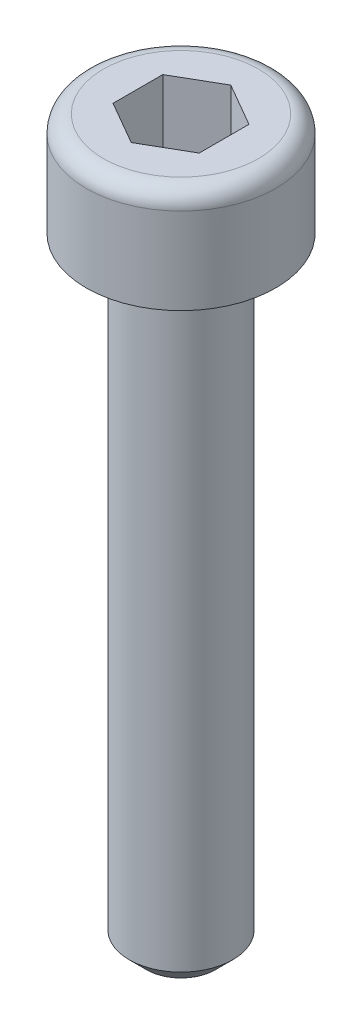
ISO-10303-21;
HEADER;
FILE_DESCRIPTION(('STEP AP214'),'2;1');
FILE_NAME('part.step','',(''),(''),'','','');
FILE_SCHEMA(('AUTOMOTIVE_DESIGN { 1 0 10303 214 1 1 1 1 }'));
ENDSEC;
DATA;
#1=APPLICATION_CONTEXT('core data for automotive mechanical design processes');
#2=APPLICATION_PROTOCOL_DEFINITION('international standard','automotive_design',2000,#1);
#3=PRODUCT_CONTEXT('',#1,'mechanical');
#4=PRODUCT('Part','Part','',(#3));
#5=PRODUCT_RELATED_PRODUCT_CATEGORY('part','',(#4));
#6=PRODUCT_DEFINITION_FORMATION('','',#4);
#7=PRODUCT_DEFINITION_CONTEXT('part definition',#1,'design');
#8=PRODUCT_DEFINITION('design','',#6,#7);
#9=PRODUCT_DEFINITION_SHAPE('','',#8);
#10=(LENGTH_UNIT() NAMED_UNIT(*) SI_UNIT(.MILLI.,.METRE.));
#11=(NAMED_UNIT(*) PLANE_ANGLE_UNIT() SI_UNIT($,.RADIAN.));
#12=(NAMED_UNIT(*) SI_UNIT($,.STERADIAN.) SOLID_ANGLE_UNIT());
#13=UNCERTAINTY_MEASURE_WITH_UNIT(LENGTH_MEASURE(1.E-05),#10,'distance_accuracy_value','');
#14=(GEOMETRIC_REPRESENTATION_CONTEXT(3) GLOBAL_UNCERTAINTY_ASSIGNED_CONTEXT((#13)) GLOBAL_UNIT_ASSIGNED_CONTEXT((#10,
#11,#12)) REPRESENTATION_CONTEXT('',''));
#15=CARTESIAN_POINT('',(0.,0.,0.));
#16=DIRECTION('',(0.,0.,1.));
#17=DIRECTION('',(1.,0.,0.));
#18=AXIS2_PLACEMENT_3D('',#15,#16,#17);
#19=CARTESIAN_POINT('',(0.,0.,0.));
#20=DIRECTION('',(0.,-1.,0.));
#21=DIRECTION('',(0.,0.,-1.));
#22=AXIS2_PLACEMENT_3D('',#19,#20,#21);
#23=PLANE('',#22);
#24=CARTESIAN_POINT('',(0.,0.,0.));
#25=DIRECTION('',(0.,-1.,0.));
#26=DIRECTION('',(0.,0.,-1.));
#27=AXIS2_PLACEMENT_3D('',#24,#25,#26);
#28=CIRCLE('',#27,2.25);
#29=CARTESIAN_POINT('',(0.,0.,-2.25));
#30=VERTEX_POINT('',#29);
#31=EDGE_CURVE('E42',#30,#30,#28,.F.);
#32=ORIENTED_EDGE('',*,*,#31,.T.);
#33=EDGE_LOOP('',(#32));
#34=FACE_BOUND('',#33,.T.);
#35=DIRECTION('',(-0.866025403784439,0.,-0.5));
#36=VECTOR('',#35,1.);
#37=CARTESIAN_POINT('',(1.25,0.,-0.721687836487032));
#38=LINE('',#37,#36);
#39=CARTESIAN_POINT('',(1.25,0.,-0.721687836487032));
#40=VERTEX_POINT('',#39);
#41=CARTESIAN_POINT('',(0.,0.,-1.44337567297406));
#42=VERTEX_POINT('',#41);
#43=EDGE_CURVE('E123',#40,#42,#38,.T.);
#44=ORIENTED_EDGE('',*,*,#43,.F.);
#45=DIRECTION('',(0.,0.,-1.));
#46=VECTOR('',#45,1.);
#47=CARTESIAN_POINT('',(1.25,0.,0.721687836487033));
#48=LINE('',#47,#46);
#49=CARTESIAN_POINT('',(1.25,0.,0.721687836487033));
#50=VERTEX_POINT('',#49);
#51=EDGE_CURVE('E49',#50,#40,#48,.T.);
#52=ORIENTED_EDGE('',*,*,#51,.F.);
#53=DIRECTION('',(0.866025403784439,0.,-0.5));
#54=VECTOR('',#53,1.);
#55=CARTESIAN_POINT('',(0.,0.,1.44337567297406));
#56=LINE('',#55,#54);
#57=CARTESIAN_POINT('',(0.,0.,1.44337567297406));
#58=VERTEX_POINT('',#57);
#59=EDGE_CURVE('E132',#58,#50,#56,.T.);
#60=ORIENTED_EDGE('',*,*,#59,.F.);
#61=DIRECTION('',(0.866025403784439,0.,0.5));
#62=VECTOR('',#61,1.);
#63=CARTESIAN_POINT('',(-1.25,0.,0.721687836487031));
#64=LINE('',#63,#62);
#65=CARTESIAN_POINT('',(-1.25,0.,0.721687836487031));
#66=VERTEX_POINT('',#65);
#67=EDGE_CURVE('E130',#66,#58,#64,.T.);
#68=ORIENTED_EDGE('',*,*,#67,.F.);
#69=DIRECTION('',(0.,0.,1.));
#70=VECTOR('',#69,1.);
#71=CARTESIAN_POINT('',(-1.25,0.,-0.721687836487033));
#72=LINE('',#71,#70);
#73=CARTESIAN_POINT('',(-1.25,0.,-0.721687836487033));
#74=VERTEX_POINT('',#73);
#75=EDGE_CURVE('E97',#74,#66,#72,.T.);
#76=ORIENTED_EDGE('',*,*,#75,.F.);
#77=DIRECTION('',(-0.866025403784439,0.,0.5));
#78=VECTOR('',#77,1.);
#79=CARTESIAN_POINT('',(0.,0.,-1.44337567297406));
#80=LINE('',#79,#78);
#81=EDGE_CURVE('E126',#42,#74,#80,.T.);
#82=ORIENTED_EDGE('',*,*,#81,.F.);
#83=EDGE_LOOP('',(#44,#52,#60,#68,#76,#82));
#84=FACE_BOUND('',#83,.T.);
#85=ADVANCED_FACE('F34',(#34,#84),#23,.F.);
#86=CARTESIAN_POINT('',(0.,0.,0.));
#87=DIRECTION('',(0.,1.,0.));
#88=DIRECTION('',(0.,0.,1.));
#89=AXIS2_PLACEMENT_3D('',#86,#87,#88);
#90=CYLINDRICAL_SURFACE('',#89,2.75);
#91=CARTESIAN_POINT('',(0.,-0.5,0.));
#92=DIRECTION('',(0.,-1.,0.));
#93=DIRECTION('',(0.,0.,-1.));
#94=AXIS2_PLACEMENT_3D('',#91,#92,#93);
#95=CIRCLE('',#94,2.75);
#96=CARTESIAN_POINT('',(0.,-0.5,-2.75));
#97=VERTEX_POINT('',#96);
#98=EDGE_CURVE('E11',#97,#97,#95,.T.);
#99=ORIENTED_EDGE('',*,*,#98,.T.);
#100=EDGE_LOOP('',(#99));
#101=FACE_BOUND('',#100,.T.);
#102=CARTESIAN_POINT('',(0.,-3.,0.));
#103=DIRECTION('',(0.,1.,0.));
#104=DIRECTION('',(0.,0.,1.));
#105=AXIS2_PLACEMENT_3D('',#102,#103,#104);
#106=CIRCLE('',#105,2.75);
#107=CARTESIAN_POINT('',(0.,-3.,2.75));
#108=VERTEX_POINT('',#107);
#109=EDGE_CURVE('E144',#108,#108,#106,.T.);
#110=ORIENTED_EDGE('',*,*,#109,.T.);
#111=EDGE_LOOP('',(#110));
#112=FACE_BOUND('',#111,.T.);
#113=ADVANCED_FACE('F166',(#101,#112),#90,.T.);
#114=CARTESIAN_POINT('',(2.75,-3.,0.));
#115=DIRECTION('',(0.,1.,0.));
#116=DIRECTION('',(0.,0.,1.));
#117=AXIS2_PLACEMENT_3D('',#114,#115,#116);
#118=PLANE('',#117);
#119=ORIENTED_EDGE('',*,*,#109,.F.);
#120=EDGE_LOOP('',(#119));
#121=FACE_BOUND('',#120,.T.);
#122=CARTESIAN_POINT('',(0.,-3.,0.));
#123=DIRECTION('',(0.,1.,0.));
#124=DIRECTION('',(0.,0.,1.));
#125=AXIS2_PLACEMENT_3D('',#122,#123,#124);
#126=CIRCLE('',#125,1.5);
#127=CARTESIAN_POINT('',(0.,-3.,1.5));
#128=VERTEX_POINT('',#127);
#129=EDGE_CURVE('E136',#128,#128,#126,.T.);
#130=ORIENTED_EDGE('',*,*,#129,.T.);
#131=EDGE_LOOP('',(#130));
#132=FACE_BOUND('',#131,.T.);
#133=ADVANCED_FACE('F171',(#121,#132),#118,.F.);
#134=CARTESIAN_POINT('',(0.,0.,0.));
#135=DIRECTION('',(0.,1.,0.));
#136=DIRECTION('',(0.,0.,1.));
#137=AXIS2_PLACEMENT_3D('',#134,#135,#136);
#138=CYLINDRICAL_SURFACE('',#137,1.5);
#139=CARTESIAN_POINT('',(0.,-20.5,0.));
#140=DIRECTION('',(0.,1.,0.));
#141=DIRECTION('',(0.,0.,1.));
#142=AXIS2_PLACEMENT_3D('',#139,#140,#141);
#143=CIRCLE('',#142,1.5);
#144=CARTESIAN_POINT('',(0.,-20.5,1.5));
#145=VERTEX_POINT('',#144);
#146=EDGE_CURVE('E147',#145,#145,#143,.T.);
#147=ORIENTED_EDGE('',*,*,#146,.T.);
#148=EDGE_LOOP('',(#147));
#149=FACE_BOUND('',#148,.T.);
#150=ORIENTED_EDGE('',*,*,#129,.F.);
#151=EDGE_LOOP('',(#150));
#152=FACE_BOUND('',#151,.T.);
#153=ADVANCED_FACE('F177',(#149,#152),#138,.T.);
#154=CARTESIAN_POINT('',(1.5,-21.,0.));
#155=DIRECTION('',(0.,1.,0.));
#156=DIRECTION('',(0.,0.,1.));
#157=AXIS2_PLACEMENT_3D('',#154,#155,#156);
#158=PLANE('',#157);
#159=CARTESIAN_POINT('',(0.,-21.,0.));
#160=DIRECTION('',(0.,1.,0.));
#161=DIRECTION('',(0.,0.,1.));
#162=AXIS2_PLACEMENT_3D('',#159,#160,#161);
#163=CIRCLE('',#162,0.999999999999997);
#164=CARTESIAN_POINT('',(0.,-21.,0.999999999999997));
#165=VERTEX_POINT('',#164);
#166=EDGE_CURVE('E150',#165,#165,#163,.F.);
#167=ORIENTED_EDGE('',*,*,#166,.T.);
#168=EDGE_LOOP('',(#167));
#169=FACE_BOUND('',#168,.T.);
#170=ADVANCED_FACE('F181',(#169),#158,.F.);
#171=CARTESIAN_POINT('',(1.25,-2.,0.721687836487033));
#172=DIRECTION('',(1.,0.,0.));
#173=DIRECTION('',(0.,0.,-1.));
#174=AXIS2_PLACEMENT_3D('',#171,#172,#173);
#175=PLANE('',#174);
#176=ORIENTED_EDGE('',*,*,#51,.T.);
#177=DIRECTION('',(0.,1.,0.));
#178=VECTOR('',#177,1.);
#179=CARTESIAN_POINT('',(1.25,-2.,-0.721687836487032));
#180=LINE('',#179,#178);
#181=CARTESIAN_POINT('',(1.25,-2.,-0.721687836487032));
#182=VERTEX_POINT('',#181);
#183=EDGE_CURVE('E79',#182,#40,#180,.T.);
#184=ORIENTED_EDGE('',*,*,#183,.F.);
#185=DIRECTION('',(0.,0.,-1.));
#186=VECTOR('',#185,1.);
#187=CARTESIAN_POINT('',(1.25,-2.,0.721687836487033));
#188=LINE('',#187,#186);
#189=CARTESIAN_POINT('',(1.25,-2.,0.721687836487033));
#190=VERTEX_POINT('',#189);
#191=EDGE_CURVE('E134',#190,#182,#188,.T.);
#192=ORIENTED_EDGE('',*,*,#191,.F.);
#193=DIRECTION('',(0.,1.,0.));
#194=VECTOR('',#193,1.);
#195=CARTESIAN_POINT('',(1.25,-2.,0.721687836487033));
#196=LINE('',#195,#194);
#197=EDGE_CURVE('E57',#190,#50,#196,.T.);
#198=ORIENTED_EDGE('',*,*,#197,.T.);
#199=EDGE_LOOP('',(#176,#184,#192,#198));
#200=FACE_BOUND('',#199,.T.);
#201=ADVANCED_FACE('F185',(#200),#175,.F.);
#202=CARTESIAN_POINT('',(0.,-2.,1.44337567297406));
#203=DIRECTION('',(0.5,0.,0.866025403784439));
#204=DIRECTION('',(0.866025403784439,0.,-0.5));
#205=AXIS2_PLACEMENT_3D('',#202,#203,#204);
#206=PLANE('',#205);
#207=ORIENTED_EDGE('',*,*,#59,.T.);
#208=ORIENTED_EDGE('',*,*,#197,.F.);
#209=DIRECTION('',(0.866025403784439,0.,-0.5));
#210=VECTOR('',#209,1.);
#211=CARTESIAN_POINT('',(0.,-2.,1.44337567297406));
#212=LINE('',#211,#210);
#213=CARTESIAN_POINT('',(0.,-2.,1.44337567297406));
#214=VERTEX_POINT('',#213);
#215=EDGE_CURVE('E109',#214,#190,#212,.T.);
#216=ORIENTED_EDGE('',*,*,#215,.F.);
#217=DIRECTION('',(0.,1.,0.));
#218=VECTOR('',#217,1.);
#219=CARTESIAN_POINT('',(0.,-2.,1.44337567297406));
#220=LINE('',#219,#218);
#221=EDGE_CURVE('E101',#214,#58,#220,.T.);
#222=ORIENTED_EDGE('',*,*,#221,.T.);
#223=EDGE_LOOP('',(#207,#208,#216,#222));
#224=FACE_BOUND('',#223,.T.);
#225=ADVANCED_FACE('F189',(#224),#206,.F.);
#226=CARTESIAN_POINT('',(-1.25,-2.,0.721687836487031));
#227=DIRECTION('',(-0.5,0.,0.866025403784439));
#228=DIRECTION('',(0.866025403784439,0.,0.5));
#229=AXIS2_PLACEMENT_3D('',#226,#227,#228);
#230=PLANE('',#229);
#231=ORIENTED_EDGE('',*,*,#67,.T.);
#232=ORIENTED_EDGE('',*,*,#221,.F.);
#233=DIRECTION('',(0.866025403784439,0.,0.5));
#234=VECTOR('',#233,1.);
#235=CARTESIAN_POINT('',(-1.25,-2.,0.721687836487031));
#236=LINE('',#235,#234);
#237=CARTESIAN_POINT('',(-1.25,-2.,0.721687836487031));
#238=VERTEX_POINT('',#237);
#239=EDGE_CURVE('E105',#238,#214,#236,.T.);
#240=ORIENTED_EDGE('',*,*,#239,.F.);
#241=DIRECTION('',(0.,1.,0.));
#242=VECTOR('',#241,1.);
#243=CARTESIAN_POINT('',(-1.25,-2.,0.721687836487031));
#244=LINE('',#243,#242);
#245=EDGE_CURVE('E90',#238,#66,#244,.T.);
#246=ORIENTED_EDGE('',*,*,#245,.T.);
#247=EDGE_LOOP('',(#231,#232,#240,#246));
#248=FACE_BOUND('',#247,.T.);
#249=ADVANCED_FACE('F106',(#248),#230,.F.);
#250=CARTESIAN_POINT('',(-1.25,-2.,-0.721687836487033));
#251=DIRECTION('',(-1.,0.,0.));
#252=DIRECTION('',(0.,0.,1.));
#253=AXIS2_PLACEMENT_3D('',#250,#251,#252);
#254=PLANE('',#253);
#255=ORIENTED_EDGE('',*,*,#75,.T.);
#256=ORIENTED_EDGE('',*,*,#245,.F.);
#257=DIRECTION('',(0.,0.,1.));
#258=VECTOR('',#257,1.);
#259=CARTESIAN_POINT('',(-1.25,-2.,-0.721687836487033));
#260=LINE('',#259,#258);
#261=CARTESIAN_POINT('',(-1.25,-2.,-0.721687836487033));
#262=VERTEX_POINT('',#261);
#263=EDGE_CURVE('E94',#262,#238,#260,.T.);
#264=ORIENTED_EDGE('',*,*,#263,.F.);
#265=DIRECTION('',(0.,1.,0.));
#266=VECTOR('',#265,1.);
#267=CARTESIAN_POINT('',(-1.25,-2.,-0.721687836487033));
#268=LINE('',#267,#266);
#269=EDGE_CURVE('E102',#262,#74,#268,.T.);
#270=ORIENTED_EDGE('',*,*,#269,.T.);
#271=EDGE_LOOP('',(#255,#256,#264,#270));
#272=FACE_BOUND('',#271,.T.);
#273=ADVANCED_FACE('F92',(#272),#254,.F.);
#274=CARTESIAN_POINT('',(0.,-2.,-1.44337567297406));
#275=DIRECTION('',(-0.5,0.,-0.866025403784439));
#276=DIRECTION('',(-0.866025403784439,0.,0.5));
#277=AXIS2_PLACEMENT_3D('',#274,#275,#276);
#278=PLANE('',#277);
#279=ORIENTED_EDGE('',*,*,#81,.T.);
#280=ORIENTED_EDGE('',*,*,#269,.F.);
#281=DIRECTION('',(-0.866025403784439,0.,0.5));
#282=VECTOR('',#281,1.);
#283=CARTESIAN_POINT('',(0.,-2.,-1.44337567297406));
#284=LINE('',#283,#282);
#285=CARTESIAN_POINT('',(0.,-2.,-1.44337567297406));
#286=VERTEX_POINT('',#285);
#287=EDGE_CURVE('E115',#286,#262,#284,.T.);
#288=ORIENTED_EDGE('',*,*,#287,.F.);
#289=DIRECTION('',(0.,1.,0.));
#290=VECTOR('',#289,1.);
#291=CARTESIAN_POINT('',(0.,-2.,-1.44337567297406));
#292=LINE('',#291,#290);
#293=EDGE_CURVE('E139',#286,#42,#292,.T.);
#294=ORIENTED_EDGE('',*,*,#293,.T.);
#295=EDGE_LOOP('',(#279,#280,#288,#294));
#296=FACE_BOUND('',#295,.T.);
#297=ADVANCED_FACE('F193',(#296),#278,.F.);
#298=CARTESIAN_POINT('',(1.25,-2.,-0.721687836487032));
#299=DIRECTION('',(0.5,0.,-0.866025403784439));
#300=DIRECTION('',(-0.866025403784439,0.,-0.5));
#301=AXIS2_PLACEMENT_3D('',#298,#299,#300);
#302=PLANE('',#301);
#303=ORIENTED_EDGE('',*,*,#43,.T.);
#304=ORIENTED_EDGE('',*,*,#293,.F.);
#305=DIRECTION('',(-0.866025403784439,0.,-0.5));
#306=VECTOR('',#305,1.);
#307=CARTESIAN_POINT('',(1.25,-2.,-0.721687836487032));
#308=LINE('',#307,#306);
#309=EDGE_CURVE('E117',#182,#286,#308,.T.);
#310=ORIENTED_EDGE('',*,*,#309,.F.);
#311=ORIENTED_EDGE('',*,*,#183,.T.);
#312=EDGE_LOOP('',(#303,#304,#310,#311));
#313=FACE_BOUND('',#312,.T.);
#314=ADVANCED_FACE('F190',(#313),#302,.F.);
#315=CARTESIAN_POINT('',(1.25,-2.,-0.721687836487032));
#316=DIRECTION('',(0.,1.,0.));
#317=DIRECTION('',(0.,0.,1.));
#318=AXIS2_PLACEMENT_3D('',#315,#316,#317);
#319=PLANE('',#318);
#320=ORIENTED_EDGE('',*,*,#191,.T.);
#321=ORIENTED_EDGE('',*,*,#309,.T.);
#322=ORIENTED_EDGE('',*,*,#287,.T.);
#323=ORIENTED_EDGE('',*,*,#263,.T.);
#324=ORIENTED_EDGE('',*,*,#239,.T.);
#325=ORIENTED_EDGE('',*,*,#215,.T.);
#326=EDGE_LOOP('',(#320,#321,#322,#323,#324,#325));
#327=FACE_BOUND('',#326,.T.);
#328=ADVANCED_FACE('F112',(#327),#319,.T.);
#329=CARTESIAN_POINT('',(0.,-20.5,0.));
#330=DIRECTION('',(0.,1.,0.));
#331=DIRECTION('',(0.,0.,1.));
#332=AXIS2_PLACEMENT_3D('',#329,#330,#331);
#333=CONICAL_SURFACE('',#332,1.5,0.785398163397452);
#334=ORIENTED_EDGE('',*,*,#166,.F.);
#335=EDGE_LOOP('',(#334));
#336=FACE_BOUND('',#335,.T.);
#337=ORIENTED_EDGE('',*,*,#146,.F.);
#338=EDGE_LOOP('',(#337));
#339=FACE_BOUND('',#338,.T.);
#340=ADVANCED_FACE('F158',(#336,#339),#333,.T.);
#341=CARTESIAN_POINT('',(0.,-0.5,0.));
#342=DIRECTION('',(0.,-1.,0.));
#343=DIRECTION('',(0.,0.,-1.));
#344=AXIS2_PLACEMENT_3D('',#341,#342,#343);
#345=TOROIDAL_SURFACE('',#344,2.25,0.5);
#346=ORIENTED_EDGE('',*,*,#98,.F.);
#347=EDGE_LOOP('',(#346));
#348=FACE_BOUND('',#347,.T.);
#349=ORIENTED_EDGE('',*,*,#31,.F.);
#350=EDGE_LOOP('',(#349));
#351=FACE_BOUND('',#350,.T.);
#352=ADVANCED_FACE('F36',(#348,#351),#345,.T.);
#353=CLOSED_SHELL('',(#85,#113,#133,#153,#170,#201,#225,#249,#273,#297,#314,#328,#340,#352));
#354=MANIFOLD_SOLID_BREP('B2',#353);
#355=ADVANCED_BREP_SHAPE_REPRESENTATION('',(#18,#354),#14);
#356=SHAPE_DEFINITION_REPRESENTATION(#9,#355);
ENDSEC;
END-ISO-10303-21;
